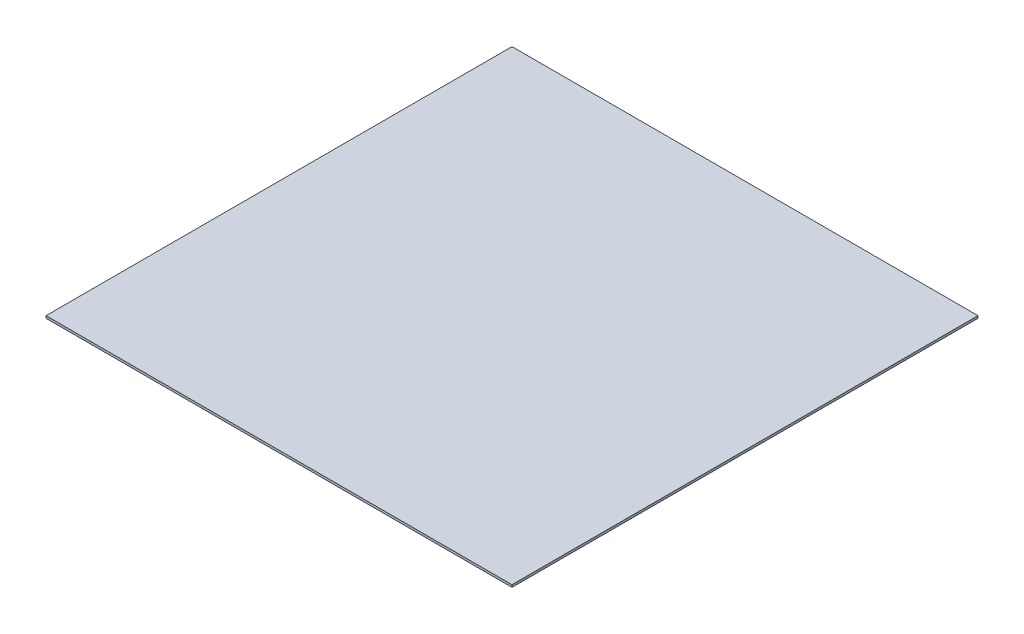
ISO-10303-21;
HEADER;
FILE_DESCRIPTION(('STEP AP214'),'2;1');
FILE_NAME('part.step','',(''),(''),'','','');
FILE_SCHEMA(('AUTOMOTIVE_DESIGN { 1 0 10303 214 1 1 1 1 }'));
ENDSEC;
DATA;
#1=APPLICATION_CONTEXT('core data for automotive mechanical design processes');
#2=APPLICATION_PROTOCOL_DEFINITION('international standard','automotive_design',2000,#1);
#3=PRODUCT_CONTEXT('',#1,'mechanical');
#4=PRODUCT('Part','Part','',(#3));
#5=PRODUCT_RELATED_PRODUCT_CATEGORY('part','',(#4));
#6=PRODUCT_DEFINITION_FORMATION('','',#4);
#7=PRODUCT_DEFINITION_CONTEXT('part definition',#1,'design');
#8=PRODUCT_DEFINITION('design','',#6,#7);
#9=PRODUCT_DEFINITION_SHAPE('','',#8);
#10=(LENGTH_UNIT() NAMED_UNIT(*) SI_UNIT(.MILLI.,.METRE.));
#11=(NAMED_UNIT(*) PLANE_ANGLE_UNIT() SI_UNIT($,.RADIAN.));
#12=(NAMED_UNIT(*) SI_UNIT($,.STERADIAN.) SOLID_ANGLE_UNIT());
#13=UNCERTAINTY_MEASURE_WITH_UNIT(LENGTH_MEASURE(1.E-05),#10,'distance_accuracy_value','');
#14=(GEOMETRIC_REPRESENTATION_CONTEXT(3) GLOBAL_UNCERTAINTY_ASSIGNED_CONTEXT((#13)) GLOBAL_UNIT_ASSIGNED_CONTEXT((#10,
#11,#12)) REPRESENTATION_CONTEXT('',''));
#15=CARTESIAN_POINT('',(0.,0.,0.));
#16=DIRECTION('',(0.,0.,1.));
#17=DIRECTION('',(1.,0.,0.));
#18=AXIS2_PLACEMENT_3D('',#15,#16,#17);
#19=CARTESIAN_POINT('',(1000.,10.,-1000.));
#20=DIRECTION('',(-1.,0.,0.));
#21=DIRECTION('',(0.,0.,1.));
#22=AXIS2_PLACEMENT_3D('',#19,#20,#21);
#23=PLANE('',#22);
#24=DIRECTION('',(0.,0.,-1.));
#25=VECTOR('',#24,1.);
#26=CARTESIAN_POINT('',(1000.,0.,-1000.));
#27=LINE('',#26,#25);
#28=CARTESIAN_POINT('',(1000.,0.,1000.));
#29=VERTEX_POINT('',#28);
#30=CARTESIAN_POINT('',(1000.,0.,-1000.));
#31=VERTEX_POINT('',#30);
#32=EDGE_CURVE('E107',#29,#31,#27,.T.);
#33=ORIENTED_EDGE('',*,*,#32,.T.);
#34=DIRECTION('',(0.,-1.,0.));
#35=VECTOR('',#34,1.);
#36=CARTESIAN_POINT('',(1000.,10.,-1000.));
#37=LINE('',#36,#35);
#38=CARTESIAN_POINT('',(1000.,10.,-1000.));
#39=VERTEX_POINT('',#38);
#40=EDGE_CURVE('E11',#39,#31,#37,.T.);
#41=ORIENTED_EDGE('',*,*,#40,.F.);
#42=DIRECTION('',(0.,0.,-1.));
#43=VECTOR('',#42,1.);
#44=CARTESIAN_POINT('',(1000.,10.,-1000.));
#45=LINE('',#44,#43);
#46=CARTESIAN_POINT('',(1000.,10.,1000.));
#47=VERTEX_POINT('',#46);
#48=EDGE_CURVE('E91',#47,#39,#45,.T.);
#49=ORIENTED_EDGE('',*,*,#48,.F.);
#50=DIRECTION('',(0.,-1.,0.));
#51=VECTOR('',#50,1.);
#52=CARTESIAN_POINT('',(1000.,10.,1000.));
#53=LINE('',#52,#51);
#54=EDGE_CURVE('E103',#47,#29,#53,.T.);
#55=ORIENTED_EDGE('',*,*,#54,.T.);
#56=EDGE_LOOP('',(#33,#41,#49,#55));
#57=FACE_BOUND('',#56,.T.);
#58=ADVANCED_FACE('F39',(#57),#23,.F.);
#59=CARTESIAN_POINT('',(-1000.,10.,-1000.));
#60=DIRECTION('',(0.,0.,1.));
#61=DIRECTION('',(1.,0.,0.));
#62=AXIS2_PLACEMENT_3D('',#59,#60,#61);
#63=PLANE('',#62);
#64=DIRECTION('',(-1.,0.,0.));
#65=VECTOR('',#64,1.);
#66=CARTESIAN_POINT('',(-1000.,0.,-1000.));
#67=LINE('',#66,#65);
#68=CARTESIAN_POINT('',(-1000.,0.,-1000.));
#69=VERTEX_POINT('',#68);
#70=EDGE_CURVE('E96',#31,#69,#67,.T.);
#71=ORIENTED_EDGE('',*,*,#70,.T.);
#72=DIRECTION('',(0.,-1.,0.));
#73=VECTOR('',#72,1.);
#74=CARTESIAN_POINT('',(-1000.,10.,-1000.));
#75=LINE('',#74,#73);
#76=CARTESIAN_POINT('',(-1000.,10.,-1000.));
#77=VERTEX_POINT('',#76);
#78=EDGE_CURVE('E48',#77,#69,#75,.T.);
#79=ORIENTED_EDGE('',*,*,#78,.F.);
#80=DIRECTION('',(-1.,0.,0.));
#81=VECTOR('',#80,1.);
#82=CARTESIAN_POINT('',(-1000.,10.,-1000.));
#83=LINE('',#82,#81);
#84=EDGE_CURVE('E86',#39,#77,#83,.T.);
#85=ORIENTED_EDGE('',*,*,#84,.F.);
#86=ORIENTED_EDGE('',*,*,#40,.T.);
#87=EDGE_LOOP('',(#71,#79,#85,#86));
#88=FACE_BOUND('',#87,.T.);
#89=ADVANCED_FACE('F95',(#88),#63,.F.);
#90=CARTESIAN_POINT('',(-1000.,10.,-1000.));
#91=DIRECTION('',(1.,0.,0.));
#92=DIRECTION('',(0.,0.,-1.));
#93=AXIS2_PLACEMENT_3D('',#90,#91,#92);
#94=PLANE('',#93);
#95=DIRECTION('',(0.,0.,1.));
#96=VECTOR('',#95,1.);
#97=CARTESIAN_POINT('',(-1000.,0.,-1000.));
#98=LINE('',#97,#96);
#99=CARTESIAN_POINT('',(-1000.,0.,1000.));
#100=VERTEX_POINT('',#99);
#101=EDGE_CURVE('E73',#69,#100,#98,.T.);
#102=ORIENTED_EDGE('',*,*,#101,.T.);
#103=DIRECTION('',(0.,-1.,0.));
#104=VECTOR('',#103,1.);
#105=CARTESIAN_POINT('',(-1000.,10.,1000.));
#106=LINE('',#105,#104);
#107=CARTESIAN_POINT('',(-1000.,10.,1000.));
#108=VERTEX_POINT('',#107);
#109=EDGE_CURVE('E98',#108,#100,#106,.T.);
#110=ORIENTED_EDGE('',*,*,#109,.F.);
#111=DIRECTION('',(0.,0.,1.));
#112=VECTOR('',#111,1.);
#113=CARTESIAN_POINT('',(-1000.,10.,-1000.));
#114=LINE('',#113,#112);
#115=EDGE_CURVE('E89',#77,#108,#114,.T.);
#116=ORIENTED_EDGE('',*,*,#115,.F.);
#117=ORIENTED_EDGE('',*,*,#78,.T.);
#118=EDGE_LOOP('',(#102,#110,#116,#117));
#119=FACE_BOUND('',#118,.T.);
#120=ADVANCED_FACE('F99',(#119),#94,.F.);
#121=CARTESIAN_POINT('',(-1000.,10.,1000.));
#122=DIRECTION('',(0.,0.,-1.));
#123=DIRECTION('',(-1.,0.,0.));
#124=AXIS2_PLACEMENT_3D('',#121,#122,#123);
#125=PLANE('',#124);
#126=DIRECTION('',(1.,0.,0.));
#127=VECTOR('',#126,1.);
#128=CARTESIAN_POINT('',(-1000.,0.,1000.));
#129=LINE('',#128,#127);
#130=EDGE_CURVE('E79',#100,#29,#129,.T.);
#131=ORIENTED_EDGE('',*,*,#130,.T.);
#132=ORIENTED_EDGE('',*,*,#54,.F.);
#133=DIRECTION('',(1.,0.,0.));
#134=VECTOR('',#133,1.);
#135=CARTESIAN_POINT('',(-1000.,10.,1000.));
#136=LINE('',#135,#134);
#137=EDGE_CURVE('E56',#108,#47,#136,.T.);
#138=ORIENTED_EDGE('',*,*,#137,.F.);
#139=ORIENTED_EDGE('',*,*,#109,.T.);
#140=EDGE_LOOP('',(#131,#132,#138,#139));
#141=FACE_BOUND('',#140,.T.);
#142=ADVANCED_FACE('F120',(#141),#125,.F.);
#143=CARTESIAN_POINT('',(0.,10.,0.));
#144=DIRECTION('',(0.,1.,0.));
#145=DIRECTION('',(0.,0.,1.));
#146=AXIS2_PLACEMENT_3D('',#143,#144,#145);
#147=PLANE('',#146);
#148=ORIENTED_EDGE('',*,*,#48,.T.);
#149=ORIENTED_EDGE('',*,*,#84,.T.);
#150=ORIENTED_EDGE('',*,*,#115,.T.);
#151=ORIENTED_EDGE('',*,*,#137,.T.);
#152=EDGE_LOOP('',(#148,#149,#150,#151));
#153=FACE_BOUND('',#152,.T.);
#154=ADVANCED_FACE('F87',(#153),#147,.T.);
#155=CARTESIAN_POINT('',(0.,0.,0.));
#156=DIRECTION('',(0.,1.,0.));
#157=DIRECTION('',(0.,0.,1.));
#158=AXIS2_PLACEMENT_3D('',#155,#156,#157);
#159=PLANE('',#158);
#160=ORIENTED_EDGE('',*,*,#32,.F.);
#161=ORIENTED_EDGE('',*,*,#130,.F.);
#162=ORIENTED_EDGE('',*,*,#101,.F.);
#163=ORIENTED_EDGE('',*,*,#70,.F.);
#164=EDGE_LOOP('',(#160,#161,#162,#163));
#165=FACE_BOUND('',#164,.T.);
#166=ADVANCED_FACE('F123',(#165),#159,.F.);
#167=CLOSED_SHELL('',(#58,#89,#120,#142,#154,#166));
#168=MANIFOLD_SOLID_BREP('B2',#167);
#169=ADVANCED_BREP_SHAPE_REPRESENTATION('',(#18,#168),#14);
#170=SHAPE_DEFINITION_REPRESENTATION(#9,#169);
ENDSEC;
END-ISO-10303-21;
